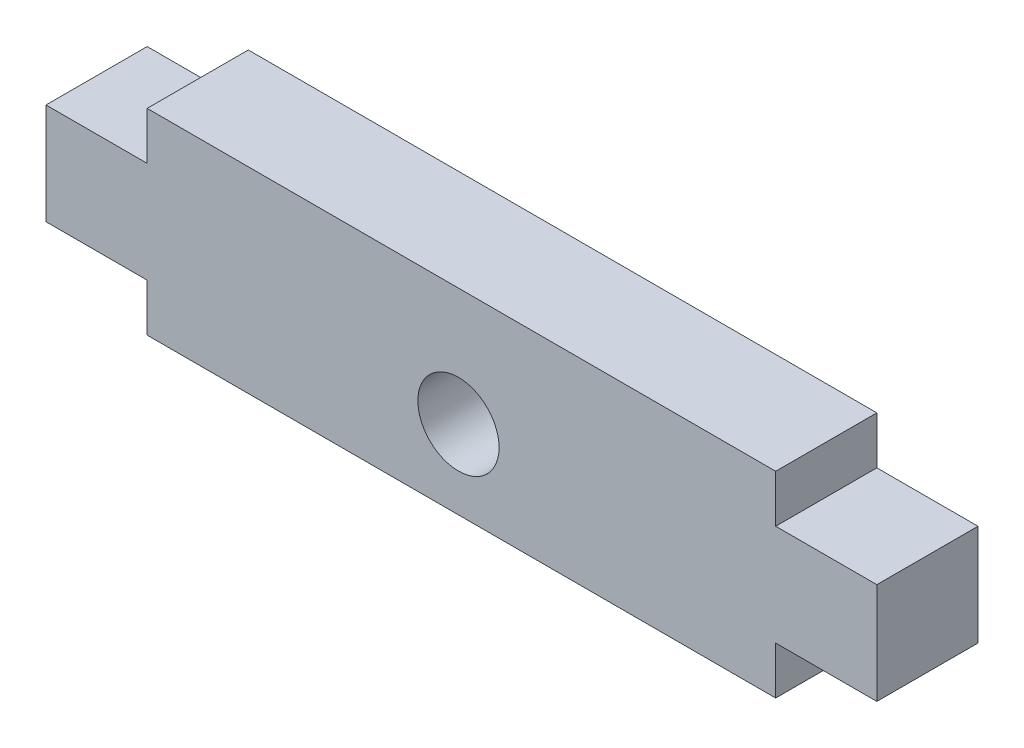
ISO-10303-21;
HEADER;
FILE_DESCRIPTION(('STEP AP214'),'2;1');
FILE_NAME('part.step','',(''),(''),'','','');
FILE_SCHEMA(('AUTOMOTIVE_DESIGN { 1 0 10303 214 1 1 1 1 }'));
ENDSEC;
DATA;
#1=APPLICATION_CONTEXT('core data for automotive mechanical design processes');
#2=APPLICATION_PROTOCOL_DEFINITION('international standard','automotive_design',2000,#1);
#3=PRODUCT_CONTEXT('',#1,'mechanical');
#4=PRODUCT('Part','Part','',(#3));
#5=PRODUCT_RELATED_PRODUCT_CATEGORY('part','',(#4));
#6=PRODUCT_DEFINITION_FORMATION('','',#4);
#7=PRODUCT_DEFINITION_CONTEXT('part definition',#1,'design');
#8=PRODUCT_DEFINITION('design','',#6,#7);
#9=PRODUCT_DEFINITION_SHAPE('','',#8);
#10=(LENGTH_UNIT() NAMED_UNIT(*) SI_UNIT(.MILLI.,.METRE.));
#11=(NAMED_UNIT(*) PLANE_ANGLE_UNIT() SI_UNIT($,.RADIAN.));
#12=(NAMED_UNIT(*) SI_UNIT($,.STERADIAN.) SOLID_ANGLE_UNIT());
#13=UNCERTAINTY_MEASURE_WITH_UNIT(LENGTH_MEASURE(1.E-05),#10,'distance_accuracy_value','');
#14=(GEOMETRIC_REPRESENTATION_CONTEXT(3) GLOBAL_UNCERTAINTY_ASSIGNED_CONTEXT((#13)) GLOBAL_UNIT_ASSIGNED_CONTEXT((#10,
#11,#12)) REPRESENTATION_CONTEXT('',''));
#15=CARTESIAN_POINT('',(0.,0.,0.));
#16=DIRECTION('',(0.,0.,1.));
#17=DIRECTION('',(1.,0.,0.));
#18=AXIS2_PLACEMENT_3D('',#15,#16,#17);
#19=CARTESIAN_POINT('',(5.15,2.425,5.15));
#20=DIRECTION('',(0.,1.,0.));
#21=DIRECTION('',(0.,0.,1.));
#22=AXIS2_PLACEMENT_3D('',#19,#20,#21);
#23=PLANE('',#22);
#24=DIRECTION('',(1.,0.,0.));
#25=VECTOR('',#24,1.);
#26=CARTESIAN_POINT('',(5.15,2.425,0.));
#27=LINE('',#26,#25);
#28=CARTESIAN_POINT('',(0.,2.425,0.));
#29=VERTEX_POINT('',#28);
#30=CARTESIAN_POINT('',(5.15,2.425,0.));
#31=VERTEX_POINT('',#30);
#32=EDGE_CURVE('E153',#29,#31,#27,.T.);
#33=ORIENTED_EDGE('',*,*,#32,.T.);
#34=DIRECTION('',(0.,0.,-1.));
#35=VECTOR('',#34,1.);
#36=CARTESIAN_POINT('',(5.15,2.425,5.15));
#37=LINE('',#36,#35);
#38=CARTESIAN_POINT('',(5.15,2.425,5.15));
#39=VERTEX_POINT('',#38);
#40=EDGE_CURVE('E11',#39,#31,#37,.T.);
#41=ORIENTED_EDGE('',*,*,#40,.F.);
#42=DIRECTION('',(1.,0.,0.));
#43=VECTOR('',#42,1.);
#44=CARTESIAN_POINT('',(5.15,2.425,5.15));
#45=LINE('',#44,#43);
#46=CARTESIAN_POINT('',(0.,2.425,5.15));
#47=VERTEX_POINT('',#46);
#48=EDGE_CURVE('E176',#47,#39,#45,.T.);
#49=ORIENTED_EDGE('',*,*,#48,.F.);
#50=DIRECTION('',(0.,0.,-1.));
#51=VECTOR('',#50,1.);
#52=CARTESIAN_POINT('',(0.,2.425,5.15));
#53=LINE('',#52,#51);
#54=EDGE_CURVE('E149',#47,#29,#53,.T.);
#55=ORIENTED_EDGE('',*,*,#54,.T.);
#56=EDGE_LOOP('',(#33,#41,#49,#55));
#57=FACE_BOUND('',#56,.T.);
#58=ADVANCED_FACE('F33',(#57),#23,.F.);
#59=CARTESIAN_POINT('',(5.15,2.425,5.15));
#60=DIRECTION('',(1.,0.,0.));
#61=DIRECTION('',(0.,1.,0.));
#62=AXIS2_PLACEMENT_3D('',#59,#60,#61);
#63=PLANE('',#62);
#64=DIRECTION('',(0.,-1.,0.));
#65=VECTOR('',#64,1.);
#66=CARTESIAN_POINT('',(5.15,2.425,0.));
#67=LINE('',#66,#65);
#68=CARTESIAN_POINT('',(5.15,0.,0.));
#69=VERTEX_POINT('',#68);
#70=EDGE_CURVE('E156',#31,#69,#67,.T.);
#71=ORIENTED_EDGE('',*,*,#70,.T.);
#72=DIRECTION('',(0.,0.,-1.));
#73=VECTOR('',#72,1.);
#74=CARTESIAN_POINT('',(5.15,0.,5.15));
#75=LINE('',#74,#73);
#76=CARTESIAN_POINT('',(5.15,0.,5.15));
#77=VERTEX_POINT('',#76);
#78=EDGE_CURVE('E41',#77,#69,#75,.T.);
#79=ORIENTED_EDGE('',*,*,#78,.F.);
#80=DIRECTION('',(0.,-1.,0.));
#81=VECTOR('',#80,1.);
#82=CARTESIAN_POINT('',(5.15,2.425,5.15));
#83=LINE('',#82,#81);
#84=EDGE_CURVE('E104',#39,#77,#83,.T.);
#85=ORIENTED_EDGE('',*,*,#84,.F.);
#86=ORIENTED_EDGE('',*,*,#40,.T.);
#87=EDGE_LOOP('',(#71,#79,#85,#86));
#88=FACE_BOUND('',#87,.T.);
#89=ADVANCED_FACE('F255',(#88),#63,.F.);
#90=CARTESIAN_POINT('',(5.15,0.,5.15));
#91=DIRECTION('',(0.,1.,0.));
#92=DIRECTION('',(0.,0.,1.));
#93=AXIS2_PLACEMENT_3D('',#90,#91,#92);
#94=PLANE('',#93);
#95=DIRECTION('',(1.,0.,0.));
#96=VECTOR('',#95,1.);
#97=CARTESIAN_POINT('',(5.15,0.,0.));
#98=LINE('',#97,#96);
#99=CARTESIAN_POINT('',(37.15,0.,0.));
#100=VERTEX_POINT('',#99);
#101=EDGE_CURVE('E159',#69,#100,#98,.T.);
#102=ORIENTED_EDGE('',*,*,#101,.T.);
#103=DIRECTION('',(0.,0.,-1.));
#104=VECTOR('',#103,1.);
#105=CARTESIAN_POINT('',(37.15,0.,5.15));
#106=LINE('',#105,#104);
#107=CARTESIAN_POINT('',(37.15,0.,5.15));
#108=VERTEX_POINT('',#107);
#109=EDGE_CURVE('E195',#108,#100,#106,.T.);
#110=ORIENTED_EDGE('',*,*,#109,.F.);
#111=DIRECTION('',(1.,0.,0.));
#112=VECTOR('',#111,1.);
#113=CARTESIAN_POINT('',(5.15,0.,5.15));
#114=LINE('',#113,#112);
#115=EDGE_CURVE('E203',#77,#108,#114,.T.);
#116=ORIENTED_EDGE('',*,*,#115,.F.);
#117=ORIENTED_EDGE('',*,*,#78,.T.);
#118=EDGE_LOOP('',(#102,#110,#116,#117));
#119=FACE_BOUND('',#118,.T.);
#120=ADVANCED_FACE('F201',(#119),#94,.F.);
#121=CARTESIAN_POINT('',(37.15,2.425,5.15));
#122=DIRECTION('',(-1.,0.,0.));
#123=DIRECTION('',(0.,0.,1.));
#124=AXIS2_PLACEMENT_3D('',#121,#122,#123);
#125=PLANE('',#124);
#126=DIRECTION('',(0.,1.,0.));
#127=VECTOR('',#126,1.);
#128=CARTESIAN_POINT('',(37.15,2.425,0.));
#129=LINE('',#128,#127);
#130=CARTESIAN_POINT('',(37.15,2.425,0.));
#131=VERTEX_POINT('',#130);
#132=EDGE_CURVE('E161',#100,#131,#129,.T.);
#133=ORIENTED_EDGE('',*,*,#132,.T.);
#134=DIRECTION('',(0.,0.,-1.));
#135=VECTOR('',#134,1.);
#136=CARTESIAN_POINT('',(37.15,2.425,5.15));
#137=LINE('',#136,#135);
#138=CARTESIAN_POINT('',(37.15,2.425,5.15));
#139=VERTEX_POINT('',#138);
#140=EDGE_CURVE('E192',#139,#131,#137,.T.);
#141=ORIENTED_EDGE('',*,*,#140,.F.);
#142=DIRECTION('',(0.,1.,0.));
#143=VECTOR('',#142,1.);
#144=CARTESIAN_POINT('',(37.15,2.425,5.15));
#145=LINE('',#144,#143);
#146=EDGE_CURVE('E221',#108,#139,#145,.T.);
#147=ORIENTED_EDGE('',*,*,#146,.F.);
#148=ORIENTED_EDGE('',*,*,#109,.T.);
#149=EDGE_LOOP('',(#133,#141,#147,#148));
#150=FACE_BOUND('',#149,.T.);
#151=ADVANCED_FACE('F212',(#150),#125,.F.);
#152=CARTESIAN_POINT('',(42.3,2.425,5.15));
#153=DIRECTION('',(0.,1.,0.));
#154=DIRECTION('',(0.,0.,1.));
#155=AXIS2_PLACEMENT_3D('',#152,#153,#154);
#156=PLANE('',#155);
#157=DIRECTION('',(1.,0.,0.));
#158=VECTOR('',#157,1.);
#159=CARTESIAN_POINT('',(42.3,2.425,0.));
#160=LINE('',#159,#158);
#161=CARTESIAN_POINT('',(42.3,2.425,0.));
#162=VERTEX_POINT('',#161);
#163=EDGE_CURVE('E163',#131,#162,#160,.T.);
#164=ORIENTED_EDGE('',*,*,#163,.T.);
#165=DIRECTION('',(0.,0.,-1.));
#166=VECTOR('',#165,1.);
#167=CARTESIAN_POINT('',(42.3,2.425,5.15));
#168=LINE('',#167,#166);
#169=CARTESIAN_POINT('',(42.3,2.425,5.15));
#170=VERTEX_POINT('',#169);
#171=EDGE_CURVE('E189',#170,#162,#168,.T.);
#172=ORIENTED_EDGE('',*,*,#171,.F.);
#173=DIRECTION('',(1.,0.,0.));
#174=VECTOR('',#173,1.);
#175=CARTESIAN_POINT('',(42.3,2.425,5.15));
#176=LINE('',#175,#174);
#177=EDGE_CURVE('E218',#139,#170,#176,.T.);
#178=ORIENTED_EDGE('',*,*,#177,.F.);
#179=ORIENTED_EDGE('',*,*,#140,.T.);
#180=EDGE_LOOP('',(#164,#172,#178,#179));
#181=FACE_BOUND('',#180,.T.);
#182=ADVANCED_FACE('F216',(#181),#156,.F.);
#183=CARTESIAN_POINT('',(42.3,7.575,5.15));
#184=DIRECTION('',(-1.,0.,0.));
#185=DIRECTION('',(0.,0.,1.));
#186=AXIS2_PLACEMENT_3D('',#183,#184,#185);
#187=PLANE('',#186);
#188=DIRECTION('',(0.,1.,0.));
#189=VECTOR('',#188,1.);
#190=CARTESIAN_POINT('',(42.3,7.575,0.));
#191=LINE('',#190,#189);
#192=CARTESIAN_POINT('',(42.3,7.575,0.));
#193=VERTEX_POINT('',#192);
#194=EDGE_CURVE('E165',#162,#193,#191,.T.);
#195=ORIENTED_EDGE('',*,*,#194,.T.);
#196=DIRECTION('',(0.,0.,-1.));
#197=VECTOR('',#196,1.);
#198=CARTESIAN_POINT('',(42.3,7.575,5.15));
#199=LINE('',#198,#197);
#200=CARTESIAN_POINT('',(42.3,7.575,5.15));
#201=VERTEX_POINT('',#200);
#202=EDGE_CURVE('E186',#201,#193,#199,.T.);
#203=ORIENTED_EDGE('',*,*,#202,.F.);
#204=DIRECTION('',(0.,1.,0.));
#205=VECTOR('',#204,1.);
#206=CARTESIAN_POINT('',(42.3,7.575,5.15));
#207=LINE('',#206,#205);
#208=EDGE_CURVE('E220',#170,#201,#207,.T.);
#209=ORIENTED_EDGE('',*,*,#208,.F.);
#210=ORIENTED_EDGE('',*,*,#171,.T.);
#211=EDGE_LOOP('',(#195,#203,#209,#210));
#212=FACE_BOUND('',#211,.T.);
#213=ADVANCED_FACE('F268',(#212),#187,.F.);
#214=CARTESIAN_POINT('',(37.15,7.575,5.15));
#215=DIRECTION('',(0.,-1.,0.));
#216=DIRECTION('',(0.,0.,-1.));
#217=AXIS2_PLACEMENT_3D('',#214,#215,#216);
#218=PLANE('',#217);
#219=DIRECTION('',(-1.,0.,0.));
#220=VECTOR('',#219,1.);
#221=CARTESIAN_POINT('',(37.15,7.575,0.));
#222=LINE('',#221,#220);
#223=CARTESIAN_POINT('',(37.15,7.575,0.));
#224=VERTEX_POINT('',#223);
#225=EDGE_CURVE('E167',#193,#224,#222,.T.);
#226=ORIENTED_EDGE('',*,*,#225,.T.);
#227=DIRECTION('',(0.,0.,-1.));
#228=VECTOR('',#227,1.);
#229=CARTESIAN_POINT('',(37.15,7.575,5.15));
#230=LINE('',#229,#228);
#231=CARTESIAN_POINT('',(37.15,7.575,5.15));
#232=VERTEX_POINT('',#231);
#233=EDGE_CURVE('E183',#232,#224,#230,.T.);
#234=ORIENTED_EDGE('',*,*,#233,.F.);
#235=DIRECTION('',(-1.,0.,0.));
#236=VECTOR('',#235,1.);
#237=CARTESIAN_POINT('',(37.15,7.575,5.15));
#238=LINE('',#237,#236);
#239=EDGE_CURVE('E223',#201,#232,#238,.T.);
#240=ORIENTED_EDGE('',*,*,#239,.F.);
#241=ORIENTED_EDGE('',*,*,#202,.T.);
#242=EDGE_LOOP('',(#226,#234,#240,#241));
#243=FACE_BOUND('',#242,.T.);
#244=ADVANCED_FACE('F271',(#243),#218,.F.);
#245=CARTESIAN_POINT('',(37.15,7.575,5.15));
#246=DIRECTION('',(-1.,0.,0.));
#247=DIRECTION('',(0.,-1.,0.));
#248=AXIS2_PLACEMENT_3D('',#245,#246,#247);
#249=PLANE('',#248);
#250=DIRECTION('',(0.,1.,0.));
#251=VECTOR('',#250,1.);
#252=CARTESIAN_POINT('',(37.15,7.575,0.));
#253=LINE('',#252,#251);
#254=CARTESIAN_POINT('',(37.15,10.,0.));
#255=VERTEX_POINT('',#254);
#256=EDGE_CURVE('E169',#224,#255,#253,.T.);
#257=ORIENTED_EDGE('',*,*,#256,.T.);
#258=DIRECTION('',(0.,0.,-1.));
#259=VECTOR('',#258,1.);
#260=CARTESIAN_POINT('',(37.15,10.,5.15));
#261=LINE('',#260,#259);
#262=CARTESIAN_POINT('',(37.15,10.,5.15));
#263=VERTEX_POINT('',#262);
#264=EDGE_CURVE('E180',#263,#255,#261,.T.);
#265=ORIENTED_EDGE('',*,*,#264,.F.);
#266=DIRECTION('',(0.,1.,0.));
#267=VECTOR('',#266,1.);
#268=CARTESIAN_POINT('',(37.15,7.575,5.15));
#269=LINE('',#268,#267);
#270=EDGE_CURVE('E229',#232,#263,#269,.T.);
#271=ORIENTED_EDGE('',*,*,#270,.F.);
#272=ORIENTED_EDGE('',*,*,#233,.T.);
#273=EDGE_LOOP('',(#257,#265,#271,#272));
#274=FACE_BOUND('',#273,.T.);
#275=ADVANCED_FACE('F235',(#274),#249,.F.);
#276=CARTESIAN_POINT('',(37.15,10.,5.15));
#277=DIRECTION('',(0.,-1.,0.));
#278=DIRECTION('',(0.,0.,-1.));
#279=AXIS2_PLACEMENT_3D('',#276,#277,#278);
#280=PLANE('',#279);
#281=DIRECTION('',(-1.,0.,0.));
#282=VECTOR('',#281,1.);
#283=CARTESIAN_POINT('',(37.15,10.,0.));
#284=LINE('',#283,#282);
#285=CARTESIAN_POINT('',(5.15000000000003,10.,0.));
#286=VERTEX_POINT('',#285);
#287=EDGE_CURVE('E171',#255,#286,#284,.T.);
#288=ORIENTED_EDGE('',*,*,#287,.T.);
#289=DIRECTION('',(0.,0.,-1.));
#290=VECTOR('',#289,1.);
#291=CARTESIAN_POINT('',(5.15000000000003,10.,5.15));
#292=LINE('',#291,#290);
#293=CARTESIAN_POINT('',(5.15000000000003,10.,5.15));
#294=VERTEX_POINT('',#293);
#295=EDGE_CURVE('E144',#294,#286,#292,.T.);
#296=ORIENTED_EDGE('',*,*,#295,.F.);
#297=DIRECTION('',(-1.,0.,0.));
#298=VECTOR('',#297,1.);
#299=CARTESIAN_POINT('',(37.15,10.,5.15));
#300=LINE('',#299,#298);
#301=EDGE_CURVE('E135',#263,#294,#300,.T.);
#302=ORIENTED_EDGE('',*,*,#301,.F.);
#303=ORIENTED_EDGE('',*,*,#264,.T.);
#304=EDGE_LOOP('',(#288,#296,#302,#303));
#305=FACE_BOUND('',#304,.T.);
#306=ADVANCED_FACE('F239',(#305),#280,.F.);
#307=CARTESIAN_POINT('',(5.15000000000003,10.,5.15));
#308=DIRECTION('',(1.,0.,0.));
#309=DIRECTION('',(0.,1.,0.));
#310=AXIS2_PLACEMENT_3D('',#307,#308,#309);
#311=PLANE('',#310);
#312=DIRECTION('',(0.,-1.,0.));
#313=VECTOR('',#312,1.);
#314=CARTESIAN_POINT('',(5.15000000000003,10.,0.));
#315=LINE('',#314,#313);
#316=CARTESIAN_POINT('',(5.15,7.575,0.));
#317=VERTEX_POINT('',#316);
#318=EDGE_CURVE('E143',#286,#317,#315,.T.);
#319=ORIENTED_EDGE('',*,*,#318,.T.);
#320=DIRECTION('',(0.,0.,-1.));
#321=VECTOR('',#320,1.);
#322=CARTESIAN_POINT('',(5.15,7.575,5.15));
#323=LINE('',#322,#321);
#324=CARTESIAN_POINT('',(5.15,7.575,5.15));
#325=VERTEX_POINT('',#324);
#326=EDGE_CURVE('E140',#325,#317,#323,.T.);
#327=ORIENTED_EDGE('',*,*,#326,.F.);
#328=DIRECTION('',(0.,-1.,0.));
#329=VECTOR('',#328,1.);
#330=CARTESIAN_POINT('',(5.15000000000003,10.,5.15));
#331=LINE('',#330,#329);
#332=EDGE_CURVE('E129',#294,#325,#331,.T.);
#333=ORIENTED_EDGE('',*,*,#332,.F.);
#334=ORIENTED_EDGE('',*,*,#295,.T.);
#335=EDGE_LOOP('',(#319,#327,#333,#334));
#336=FACE_BOUND('',#335,.T.);
#337=ADVANCED_FACE('F141',(#336),#311,.F.);
#338=CARTESIAN_POINT('',(0.,7.575,5.15));
#339=DIRECTION('',(0.,-1.,0.));
#340=DIRECTION('',(1.,0.,0.));
#341=AXIS2_PLACEMENT_3D('',#338,#339,#340);
#342=PLANE('',#341);
#343=DIRECTION('',(-1.,0.,0.));
#344=VECTOR('',#343,1.);
#345=CARTESIAN_POINT('',(0.,7.575,0.));
#346=LINE('',#345,#344);
#347=CARTESIAN_POINT('',(0.,7.575,0.));
#348=VERTEX_POINT('',#347);
#349=EDGE_CURVE('E90',#317,#348,#346,.T.);
#350=ORIENTED_EDGE('',*,*,#349,.T.);
#351=DIRECTION('',(0.,0.,-1.));
#352=VECTOR('',#351,1.);
#353=CARTESIAN_POINT('',(0.,7.575,5.15));
#354=LINE('',#353,#352);
#355=CARTESIAN_POINT('',(0.,7.575,5.15));
#356=VERTEX_POINT('',#355);
#357=EDGE_CURVE('E145',#356,#348,#354,.T.);
#358=ORIENTED_EDGE('',*,*,#357,.F.);
#359=DIRECTION('',(-1.,0.,0.));
#360=VECTOR('',#359,1.);
#361=CARTESIAN_POINT('',(0.,7.575,5.15));
#362=LINE('',#361,#360);
#363=EDGE_CURVE('E133',#325,#356,#362,.T.);
#364=ORIENTED_EDGE('',*,*,#363,.F.);
#365=ORIENTED_EDGE('',*,*,#326,.T.);
#366=EDGE_LOOP('',(#350,#358,#364,#365));
#367=FACE_BOUND('',#366,.T.);
#368=ADVANCED_FACE('F147',(#367),#342,.F.);
#369=CARTESIAN_POINT('',(0.,2.425,5.15));
#370=DIRECTION('',(1.,0.,0.));
#371=DIRECTION('',(0.,1.,0.));
#372=AXIS2_PLACEMENT_3D('',#369,#370,#371);
#373=PLANE('',#372);
#374=DIRECTION('',(0.,-1.,0.));
#375=VECTOR('',#374,1.);
#376=CARTESIAN_POINT('',(0.,2.425,0.));
#377=LINE('',#376,#375);
#378=EDGE_CURVE('E96',#348,#29,#377,.T.);
#379=ORIENTED_EDGE('',*,*,#378,.T.);
#380=ORIENTED_EDGE('',*,*,#54,.F.);
#381=DIRECTION('',(0.,-1.,0.));
#382=VECTOR('',#381,1.);
#383=CARTESIAN_POINT('',(0.,2.425,5.15));
#384=LINE('',#383,#382);
#385=EDGE_CURVE('E49',#356,#47,#384,.T.);
#386=ORIENTED_EDGE('',*,*,#385,.F.);
#387=ORIENTED_EDGE('',*,*,#357,.T.);
#388=EDGE_LOOP('',(#379,#380,#386,#387));
#389=FACE_BOUND('',#388,.T.);
#390=ADVANCED_FACE('F243',(#389),#373,.F.);
#391=CARTESIAN_POINT('',(0.,0.,5.15));
#392=DIRECTION('',(0.,0.,-1.));
#393=DIRECTION('',(-1.,0.,0.));
#394=AXIS2_PLACEMENT_3D('',#391,#392,#393);
#395=PLANE('',#394);
#396=CARTESIAN_POINT('',(21.,4.,5.15));
#397=DIRECTION('',(0.,0.,1.));
#398=DIRECTION('',(1.,0.,0.));
#399=AXIS2_PLACEMENT_3D('',#396,#397,#398);
#400=CIRCLE('',#399,2.0675);
#401=CARTESIAN_POINT('',(23.0675,4.,5.15));
#402=VERTEX_POINT('',#401);
#403=EDGE_CURVE('E326',#402,#402,#400,.T.);
#404=ORIENTED_EDGE('',*,*,#403,.F.);
#405=EDGE_LOOP('',(#404));
#406=FACE_BOUND('',#405,.T.);
#407=ORIENTED_EDGE('',*,*,#48,.T.);
#408=ORIENTED_EDGE('',*,*,#84,.T.);
#409=ORIENTED_EDGE('',*,*,#115,.T.);
#410=ORIENTED_EDGE('',*,*,#146,.T.);
#411=ORIENTED_EDGE('',*,*,#177,.T.);
#412=ORIENTED_EDGE('',*,*,#208,.T.);
#413=ORIENTED_EDGE('',*,*,#239,.T.);
#414=ORIENTED_EDGE('',*,*,#270,.T.);
#415=ORIENTED_EDGE('',*,*,#301,.T.);
#416=ORIENTED_EDGE('',*,*,#332,.T.);
#417=ORIENTED_EDGE('',*,*,#363,.T.);
#418=ORIENTED_EDGE('',*,*,#385,.T.);
#419=EDGE_LOOP('',(#407,#408,#409,#410,#411,#412,#413,#414,#415,#416,#417,#418));
#420=FACE_BOUND('',#419,.T.);
#421=ADVANCED_FACE('F131',(#406,#420),#395,.F.);
#422=CARTESIAN_POINT('',(0.,0.,0.));
#423=DIRECTION('',(0.,0.,-1.));
#424=DIRECTION('',(-1.,0.,0.));
#425=AXIS2_PLACEMENT_3D('',#422,#423,#424);
#426=PLANE('',#425);
#427=CARTESIAN_POINT('',(21.,4.,0.));
#428=DIRECTION('',(0.,0.,1.));
#429=DIRECTION('',(1.,0.,0.));
#430=AXIS2_PLACEMENT_3D('',#427,#428,#429);
#431=CIRCLE('',#430,2.0675);
#432=CARTESIAN_POINT('',(23.0675,4.,0.));
#433=VERTEX_POINT('',#432);
#434=EDGE_CURVE('E157',#433,#433,#431,.T.);
#435=ORIENTED_EDGE('',*,*,#434,.T.);
#436=EDGE_LOOP('',(#435));
#437=FACE_BOUND('',#436,.T.);
#438=ORIENTED_EDGE('',*,*,#32,.F.);
#439=ORIENTED_EDGE('',*,*,#378,.F.);
#440=ORIENTED_EDGE('',*,*,#349,.F.);
#441=ORIENTED_EDGE('',*,*,#318,.F.);
#442=ORIENTED_EDGE('',*,*,#287,.F.);
#443=ORIENTED_EDGE('',*,*,#256,.F.);
#444=ORIENTED_EDGE('',*,*,#225,.F.);
#445=ORIENTED_EDGE('',*,*,#194,.F.);
#446=ORIENTED_EDGE('',*,*,#163,.F.);
#447=ORIENTED_EDGE('',*,*,#132,.F.);
#448=ORIENTED_EDGE('',*,*,#101,.F.);
#449=ORIENTED_EDGE('',*,*,#70,.F.);
#450=EDGE_LOOP('',(#438,#439,#440,#441,#442,#443,#444,#445,#446,#447,#448,#449));
#451=FACE_BOUND('',#450,.T.);
#452=ADVANCED_FACE('F207',(#437,#451),#426,.T.);
#453=CARTESIAN_POINT('',(21.,4.,0.));
#454=DIRECTION('',(0.,0.,1.));
#455=DIRECTION('',(1.,0.,0.));
#456=AXIS2_PLACEMENT_3D('',#453,#454,#455);
#457=CYLINDRICAL_SURFACE('',#456,2.0675);
#458=ORIENTED_EDGE('',*,*,#434,.F.);
#459=EDGE_LOOP('',(#458));
#460=FACE_BOUND('',#459,.T.);
#461=ORIENTED_EDGE('',*,*,#403,.T.);
#462=EDGE_LOOP('',(#461));
#463=FACE_BOUND('',#462,.T.);
#464=ADVANCED_FACE('F308',(#460,#463),#457,.F.);
#465=CLOSED_SHELL('',(#58,#89,#120,#151,#182,#213,#244,#275,#306,#337,#368,#390,#421,#452,#464));
#466=MANIFOLD_SOLID_BREP('B2',#465);
#467=ADVANCED_BREP_SHAPE_REPRESENTATION('',(#18,#466),#14);
#468=SHAPE_DEFINITION_REPRESENTATION(#9,#467);
ENDSEC;
END-ISO-10303-21;
